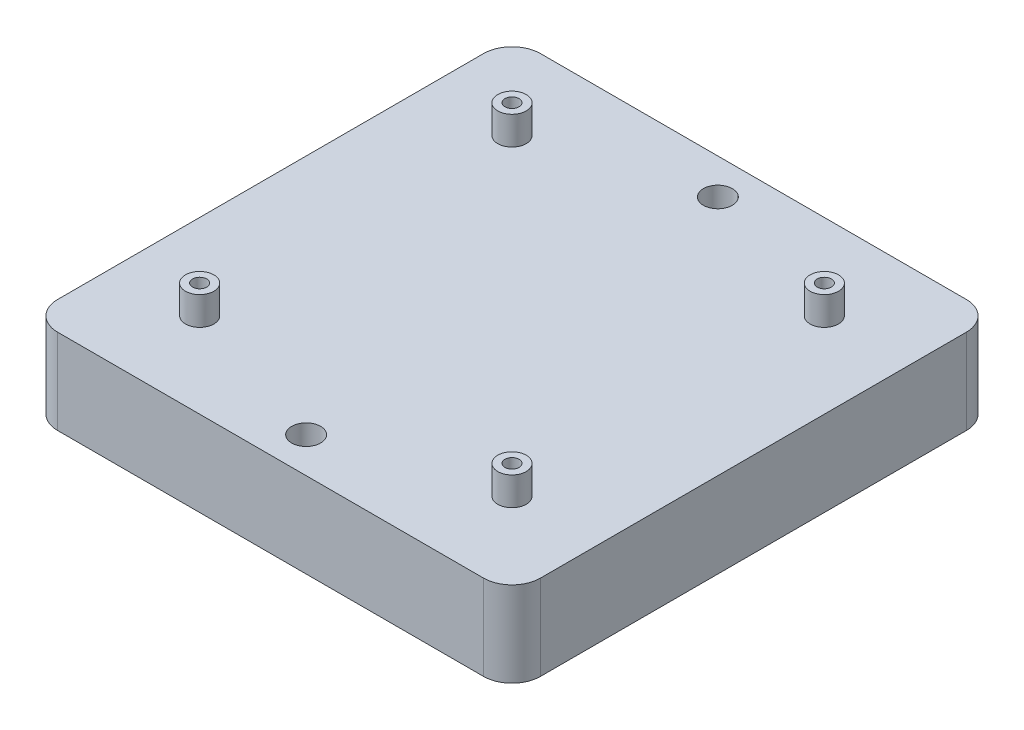
ISO-10303-21;
HEADER;
FILE_DESCRIPTION(('STEP AP214'),'2;1');
FILE_NAME('part.step','',(''),(''),'','','');
FILE_SCHEMA(('AUTOMOTIVE_DESIGN { 1 0 10303 214 1 1 1 1 }'));
ENDSEC;
DATA;
#1=APPLICATION_CONTEXT('core data for automotive mechanical design processes');
#2=APPLICATION_PROTOCOL_DEFINITION('international standard','automotive_design',2000,#1);
#3=PRODUCT_CONTEXT('',#1,'mechanical');
#4=PRODUCT('Part','Part','',(#3));
#5=PRODUCT_RELATED_PRODUCT_CATEGORY('part','',(#4));
#6=PRODUCT_DEFINITION_FORMATION('','',#4);
#7=PRODUCT_DEFINITION_CONTEXT('part definition',#1,'design');
#8=PRODUCT_DEFINITION('design','',#6,#7);
#9=PRODUCT_DEFINITION_SHAPE('','',#8);
#10=(LENGTH_UNIT() NAMED_UNIT(*) SI_UNIT(.MILLI.,.METRE.));
#11=(NAMED_UNIT(*) PLANE_ANGLE_UNIT() SI_UNIT($,.RADIAN.));
#12=(NAMED_UNIT(*) SI_UNIT($,.STERADIAN.) SOLID_ANGLE_UNIT());
#13=UNCERTAINTY_MEASURE_WITH_UNIT(LENGTH_MEASURE(1.E-05),#10,'distance_accuracy_value','');
#14=(GEOMETRIC_REPRESENTATION_CONTEXT(3) GLOBAL_UNCERTAINTY_ASSIGNED_CONTEXT((#13)) GLOBAL_UNIT_ASSIGNED_CONTEXT((#10,
#11,#12)) REPRESENTATION_CONTEXT('',''));
#15=CARTESIAN_POINT('',(0.,0.,0.));
#16=DIRECTION('',(0.,0.,1.));
#17=DIRECTION('',(1.,0.,0.));
#18=AXIS2_PLACEMENT_3D('',#15,#16,#17);
#19=CARTESIAN_POINT('',(0.,30.,0.));
#20=DIRECTION('',(1.,0.,0.));
#21=DIRECTION('',(0.,0.,-1.));
#22=AXIS2_PLACEMENT_3D('',#19,#20,#21);
#23=PLANE('',#22);
#24=DIRECTION('',(0.,0.,1.));
#25=VECTOR('',#24,1.);
#26=CARTESIAN_POINT('',(0.,0.,0.));
#27=LINE('',#26,#25);
#28=CARTESIAN_POINT('',(0.,0.,-160.));
#29=VERTEX_POINT('',#28);
#30=CARTESIAN_POINT('',(0.,0.,-10.));
#31=VERTEX_POINT('',#30);
#32=EDGE_CURVE('E161',#29,#31,#27,.T.);
#33=ORIENTED_EDGE('',*,*,#32,.T.);
#34=DIRECTION('',(0.,-1.,0.));
#35=VECTOR('',#34,1.);
#36=CARTESIAN_POINT('',(0.,30.,-10.));
#37=LINE('',#36,#35);
#38=CARTESIAN_POINT('',(0.,30.,-10.));
#39=VERTEX_POINT('',#38);
#40=EDGE_CURVE('E12',#31,#39,#37,.F.);
#41=ORIENTED_EDGE('',*,*,#40,.T.);
#42=DIRECTION('',(0.,0.,1.));
#43=VECTOR('',#42,1.);
#44=CARTESIAN_POINT('',(0.,30.,0.));
#45=LINE('',#44,#43);
#46=CARTESIAN_POINT('',(0.,30.,-160.));
#47=VERTEX_POINT('',#46);
#48=EDGE_CURVE('E159',#47,#39,#45,.T.);
#49=ORIENTED_EDGE('',*,*,#48,.F.);
#50=DIRECTION('',(0.,-1.,0.));
#51=VECTOR('',#50,1.);
#52=CARTESIAN_POINT('',(0.,30.,-160.));
#53=LINE('',#52,#51);
#54=EDGE_CURVE('E68',#47,#29,#53,.T.);
#55=ORIENTED_EDGE('',*,*,#54,.T.);
#56=EDGE_LOOP('',(#33,#41,#49,#55));
#57=FACE_BOUND('',#56,.T.);
#58=ADVANCED_FACE('F59',(#57),#23,.F.);
#59=CARTESIAN_POINT('',(0.,30.,0.));
#60=DIRECTION('',(0.,0.,-1.));
#61=DIRECTION('',(-1.,0.,0.));
#62=AXIS2_PLACEMENT_3D('',#59,#60,#61);
#63=PLANE('',#62);
#64=DIRECTION('',(1.,0.,0.));
#65=VECTOR('',#64,1.);
#66=CARTESIAN_POINT('',(0.,0.,0.));
#67=LINE('',#66,#65);
#68=CARTESIAN_POINT('',(10.,0.,0.));
#69=VERTEX_POINT('',#68);
#70=CARTESIAN_POINT('',(160.,0.,0.));
#71=VERTEX_POINT('',#70);
#72=EDGE_CURVE('E155',#69,#71,#67,.T.);
#73=ORIENTED_EDGE('',*,*,#72,.T.);
#74=DIRECTION('',(0.,-1.,0.));
#75=VECTOR('',#74,1.);
#76=CARTESIAN_POINT('',(160.,30.,0.));
#77=LINE('',#76,#75);
#78=CARTESIAN_POINT('',(160.,30.,0.));
#79=VERTEX_POINT('',#78);
#80=EDGE_CURVE('E131',#71,#79,#77,.F.);
#81=ORIENTED_EDGE('',*,*,#80,.T.);
#82=DIRECTION('',(1.,0.,0.));
#83=VECTOR('',#82,1.);
#84=CARTESIAN_POINT('',(0.,30.,0.));
#85=LINE('',#84,#83);
#86=CARTESIAN_POINT('',(10.,30.,0.));
#87=VERTEX_POINT('',#86);
#88=EDGE_CURVE('E234',#87,#79,#85,.T.);
#89=ORIENTED_EDGE('',*,*,#88,.F.);
#90=DIRECTION('',(0.,-1.,0.));
#91=VECTOR('',#90,1.);
#92=CARTESIAN_POINT('',(10.,30.,0.));
#93=LINE('',#92,#91);
#94=EDGE_CURVE('E137',#87,#69,#93,.T.);
#95=ORIENTED_EDGE('',*,*,#94,.T.);
#96=EDGE_LOOP('',(#73,#81,#89,#95));
#97=FACE_BOUND('',#96,.T.);
#98=ADVANCED_FACE('F330',(#97),#63,.F.);
#99=CARTESIAN_POINT('',(170.,30.,0.));
#100=DIRECTION('',(-1.,0.,0.));
#101=DIRECTION('',(0.,0.,1.));
#102=AXIS2_PLACEMENT_3D('',#99,#100,#101);
#103=PLANE('',#102);
#104=DIRECTION('',(0.,0.,-1.));
#105=VECTOR('',#104,1.);
#106=CARTESIAN_POINT('',(170.,30.,0.));
#107=LINE('',#106,#105);
#108=CARTESIAN_POINT('',(170.,30.,-10.));
#109=VERTEX_POINT('',#108);
#110=CARTESIAN_POINT('',(170.,30.,-160.));
#111=VERTEX_POINT('',#110);
#112=EDGE_CURVE('E146',#109,#111,#107,.T.);
#113=ORIENTED_EDGE('',*,*,#112,.F.);
#114=DIRECTION('',(0.,-1.,0.));
#115=VECTOR('',#114,1.);
#116=CARTESIAN_POINT('',(170.,30.,-10.));
#117=LINE('',#116,#115);
#118=CARTESIAN_POINT('',(170.,0.,-10.));
#119=VERTEX_POINT('',#118);
#120=EDGE_CURVE('E130',#109,#119,#117,.T.);
#121=ORIENTED_EDGE('',*,*,#120,.T.);
#122=DIRECTION('',(0.,0.,-1.));
#123=VECTOR('',#122,1.);
#124=CARTESIAN_POINT('',(170.,0.,0.));
#125=LINE('',#124,#123);
#126=CARTESIAN_POINT('',(170.,0.,-160.));
#127=VERTEX_POINT('',#126);
#128=EDGE_CURVE('E144',#119,#127,#125,.T.);
#129=ORIENTED_EDGE('',*,*,#128,.T.);
#130=DIRECTION('',(0.,-1.,0.));
#131=VECTOR('',#130,1.);
#132=CARTESIAN_POINT('',(170.,30.,-160.));
#133=LINE('',#132,#131);
#134=EDGE_CURVE('E149',#127,#111,#133,.F.);
#135=ORIENTED_EDGE('',*,*,#134,.T.);
#136=EDGE_LOOP('',(#113,#121,#129,#135));
#137=FACE_BOUND('',#136,.T.);
#138=ADVANCED_FACE('F143',(#137),#103,.F.);
#139=CARTESIAN_POINT('',(0.,30.,-170.));
#140=DIRECTION('',(0.,0.,1.));
#141=DIRECTION('',(1.,0.,0.));
#142=AXIS2_PLACEMENT_3D('',#139,#140,#141);
#143=PLANE('',#142);
#144=DIRECTION('',(-1.,0.,0.));
#145=VECTOR('',#144,1.);
#146=CARTESIAN_POINT('',(0.,30.,-170.));
#147=LINE('',#146,#145);
#148=CARTESIAN_POINT('',(160.,30.,-170.));
#149=VERTEX_POINT('',#148);
#150=CARTESIAN_POINT('',(10.,30.,-170.));
#151=VERTEX_POINT('',#150);
#152=EDGE_CURVE('E170',#149,#151,#147,.T.);
#153=ORIENTED_EDGE('',*,*,#152,.F.);
#154=DIRECTION('',(0.,-1.,0.));
#155=VECTOR('',#154,1.);
#156=CARTESIAN_POINT('',(160.,30.,-170.));
#157=LINE('',#156,#155);
#158=CARTESIAN_POINT('',(160.,0.,-170.));
#159=VERTEX_POINT('',#158);
#160=EDGE_CURVE('E209',#149,#159,#157,.T.);
#161=ORIENTED_EDGE('',*,*,#160,.T.);
#162=DIRECTION('',(-1.,0.,0.));
#163=VECTOR('',#162,1.);
#164=CARTESIAN_POINT('',(0.,0.,-170.));
#165=LINE('',#164,#163);
#166=CARTESIAN_POINT('',(10.,0.,-170.));
#167=VERTEX_POINT('',#166);
#168=EDGE_CURVE('E154',#159,#167,#165,.T.);
#169=ORIENTED_EDGE('',*,*,#168,.T.);
#170=DIRECTION('',(0.,-1.,0.));
#171=VECTOR('',#170,1.);
#172=CARTESIAN_POINT('',(10.,30.,-170.));
#173=LINE('',#172,#171);
#174=EDGE_CURVE('E75',#167,#151,#173,.F.);
#175=ORIENTED_EDGE('',*,*,#174,.T.);
#176=EDGE_LOOP('',(#153,#161,#169,#175));
#177=FACE_BOUND('',#176,.T.);
#178=ADVANCED_FACE('F313',(#177),#143,.F.);
#179=CARTESIAN_POINT('',(0.,30.,0.));
#180=DIRECTION('',(0.,-1.,0.));
#181=DIRECTION('',(0.,0.,-1.));
#182=AXIS2_PLACEMENT_3D('',#179,#180,#181);
#183=PLANE('',#182);
#184=CARTESIAN_POINT('',(140.,30.,-30.));
#185=DIRECTION('',(0.,-1.,0.));
#186=DIRECTION('',(0.,0.,-1.));
#187=AXIS2_PLACEMENT_3D('',#184,#185,#186);
#188=CIRCLE('',#187,4.99999999999999);
#189=CARTESIAN_POINT('',(140.,30.,-35.));
#190=VERTEX_POINT('',#189);
#191=EDGE_CURVE('E178',#190,#190,#188,.F.);
#192=ORIENTED_EDGE('',*,*,#191,.F.);
#193=EDGE_LOOP('',(#192));
#194=FACE_BOUND('',#193,.T.);
#195=CARTESIAN_POINT('',(140.,30.,-140.));
#196=DIRECTION('',(0.,-1.,0.));
#197=DIRECTION('',(0.,0.,-1.));
#198=AXIS2_PLACEMENT_3D('',#195,#196,#197);
#199=CIRCLE('',#198,4.99999999999998);
#200=CARTESIAN_POINT('',(140.,30.,-145.));
#201=VERTEX_POINT('',#200);
#202=EDGE_CURVE('E174',#201,#201,#199,.F.);
#203=ORIENTED_EDGE('',*,*,#202,.F.);
#204=EDGE_LOOP('',(#203));
#205=FACE_BOUND('',#204,.T.);
#206=CARTESIAN_POINT('',(29.9999999999996,30.,-140.));
#207=DIRECTION('',(0.,-1.,0.));
#208=DIRECTION('',(0.,0.,-1.));
#209=AXIS2_PLACEMENT_3D('',#206,#207,#208);
#210=CIRCLE('',#209,4.99999999999999);
#211=CARTESIAN_POINT('',(29.9999999999996,30.,-145.));
#212=VERTEX_POINT('',#211);
#213=EDGE_CURVE('E169',#212,#212,#210,.F.);
#214=ORIENTED_EDGE('',*,*,#213,.F.);
#215=EDGE_LOOP('',(#214));
#216=FACE_BOUND('',#215,.T.);
#217=CARTESIAN_POINT('',(30.,30.,-30.));
#218=DIRECTION('',(0.,-1.,0.));
#219=DIRECTION('',(0.,0.,-1.));
#220=AXIS2_PLACEMENT_3D('',#217,#218,#219);
#221=CIRCLE('',#220,5.);
#222=CARTESIAN_POINT('',(30.,30.,-35.));
#223=VERTEX_POINT('',#222);
#224=EDGE_CURVE('E165',#223,#223,#221,.F.);
#225=ORIENTED_EDGE('',*,*,#224,.F.);
#226=EDGE_LOOP('',(#225));
#227=FACE_BOUND('',#226,.T.);
#228=CARTESIAN_POINT('',(85.,30.,-157.5));
#229=DIRECTION('',(0.,1.,0.));
#230=DIRECTION('',(0.,0.,1.));
#231=AXIS2_PLACEMENT_3D('',#228,#229,#230);
#232=CIRCLE('',#231,5.1);
#233=CARTESIAN_POINT('',(85.,30.,-152.4));
#234=VERTEX_POINT('',#233);
#235=EDGE_CURVE('E227',#234,#234,#232,.T.);
#236=ORIENTED_EDGE('',*,*,#235,.F.);
#237=EDGE_LOOP('',(#236));
#238=FACE_BOUND('',#237,.T.);
#239=CARTESIAN_POINT('',(85.,30.,-12.5));
#240=DIRECTION('',(0.,1.,0.));
#241=DIRECTION('',(0.,0.,1.));
#242=AXIS2_PLACEMENT_3D('',#239,#240,#241);
#243=CIRCLE('',#242,5.1);
#244=CARTESIAN_POINT('',(85.,30.,-7.4));
#245=VERTEX_POINT('',#244);
#246=EDGE_CURVE('E244',#245,#245,#243,.T.);
#247=ORIENTED_EDGE('',*,*,#246,.F.);
#248=EDGE_LOOP('',(#247));
#249=FACE_BOUND('',#248,.T.);
#250=ORIENTED_EDGE('',*,*,#88,.T.);
#251=CARTESIAN_POINT('',(160.,30.,-10.));
#252=DIRECTION('',(0.,-1.,0.));
#253=DIRECTION('',(0.,0.,-1.));
#254=AXIS2_PLACEMENT_3D('',#251,#252,#253);
#255=CIRCLE('',#254,10.);
#256=EDGE_CURVE('E204',#79,#109,#255,.F.);
#257=ORIENTED_EDGE('',*,*,#256,.T.);
#258=ORIENTED_EDGE('',*,*,#112,.T.);
#259=CARTESIAN_POINT('',(160.,30.,-160.));
#260=DIRECTION('',(0.,-1.,0.));
#261=DIRECTION('',(0.,0.,-1.));
#262=AXIS2_PLACEMENT_3D('',#259,#260,#261);
#263=CIRCLE('',#262,10.);
#264=EDGE_CURVE('E82',#111,#149,#263,.F.);
#265=ORIENTED_EDGE('',*,*,#264,.T.);
#266=ORIENTED_EDGE('',*,*,#152,.T.);
#267=CARTESIAN_POINT('',(10.,30.,-160.));
#268=DIRECTION('',(0.,-1.,0.));
#269=DIRECTION('',(0.,0.,-1.));
#270=AXIS2_PLACEMENT_3D('',#267,#268,#269);
#271=CIRCLE('',#270,10.);
#272=EDGE_CURVE('E196',#151,#47,#271,.F.);
#273=ORIENTED_EDGE('',*,*,#272,.T.);
#274=ORIENTED_EDGE('',*,*,#48,.T.);
#275=CARTESIAN_POINT('',(10.,30.,-10.));
#276=DIRECTION('',(0.,-1.,0.));
#277=DIRECTION('',(0.,0.,-1.));
#278=AXIS2_PLACEMENT_3D('',#275,#276,#277);
#279=CIRCLE('',#278,10.);
#280=EDGE_CURVE('E199',#39,#87,#279,.F.);
#281=ORIENTED_EDGE('',*,*,#280,.T.);
#282=EDGE_LOOP('',(#250,#257,#258,#265,#266,#273,#274,#281));
#283=FACE_BOUND('',#282,.T.);
#284=ADVANCED_FACE('F310',(#194,#205,#216,#227,#238,#249,#283),#183,.F.);
#285=CARTESIAN_POINT('',(0.,0.,0.));
#286=DIRECTION('',(0.,-1.,0.));
#287=DIRECTION('',(0.,0.,-1.));
#288=AXIS2_PLACEMENT_3D('',#285,#286,#287);
#289=PLANE('',#288);
#290=ORIENTED_EDGE('',*,*,#128,.F.);
#291=CARTESIAN_POINT('',(160.,0.,-10.));
#292=DIRECTION('',(0.,-1.,0.));
#293=DIRECTION('',(0.,0.,-1.));
#294=AXIS2_PLACEMENT_3D('',#291,#292,#293);
#295=CIRCLE('',#294,10.);
#296=EDGE_CURVE('E126',#119,#71,#295,.T.);
#297=ORIENTED_EDGE('',*,*,#296,.T.);
#298=ORIENTED_EDGE('',*,*,#72,.F.);
#299=CARTESIAN_POINT('',(10.,0.,-10.));
#300=DIRECTION('',(0.,-1.,0.));
#301=DIRECTION('',(0.,0.,-1.));
#302=AXIS2_PLACEMENT_3D('',#299,#300,#301);
#303=CIRCLE('',#302,10.);
#304=EDGE_CURVE('E186',#69,#31,#303,.T.);
#305=ORIENTED_EDGE('',*,*,#304,.T.);
#306=ORIENTED_EDGE('',*,*,#32,.F.);
#307=CARTESIAN_POINT('',(10.,0.,-160.));
#308=DIRECTION('',(0.,-1.,0.));
#309=DIRECTION('',(0.,0.,-1.));
#310=AXIS2_PLACEMENT_3D('',#307,#308,#309);
#311=CIRCLE('',#310,10.);
#312=EDGE_CURVE('E148',#29,#167,#311,.T.);
#313=ORIENTED_EDGE('',*,*,#312,.T.);
#314=ORIENTED_EDGE('',*,*,#168,.F.);
#315=CARTESIAN_POINT('',(160.,0.,-160.));
#316=DIRECTION('',(0.,-1.,0.));
#317=DIRECTION('',(0.,0.,-1.));
#318=AXIS2_PLACEMENT_3D('',#315,#316,#317);
#319=CIRCLE('',#318,10.);
#320=EDGE_CURVE('E138',#159,#127,#319,.T.);
#321=ORIENTED_EDGE('',*,*,#320,.T.);
#322=EDGE_LOOP('',(#290,#297,#298,#305,#306,#313,#314,#321));
#323=FACE_BOUND('',#322,.T.);
#324=ADVANCED_FACE('F151',(#323),#289,.T.);
#325=CARTESIAN_POINT('',(85.,5.,-12.5));
#326=DIRECTION('',(0.,1.,0.));
#327=DIRECTION('',(0.,0.,1.));
#328=AXIS2_PLACEMENT_3D('',#325,#326,#327);
#329=CYLINDRICAL_SURFACE('',#328,5.1);
#330=CARTESIAN_POINT('',(85.,5.,-12.5));
#331=DIRECTION('',(0.,1.,0.));
#332=DIRECTION('',(0.,0.,1.));
#333=AXIS2_PLACEMENT_3D('',#330,#331,#332);
#334=CIRCLE('',#333,5.1);
#335=CARTESIAN_POINT('',(85.,5.,-7.4));
#336=VERTEX_POINT('',#335);
#337=EDGE_CURVE('E240',#336,#336,#334,.T.);
#338=ORIENTED_EDGE('',*,*,#337,.F.);
#339=EDGE_LOOP('',(#338));
#340=FACE_BOUND('',#339,.T.);
#341=ORIENTED_EDGE('',*,*,#246,.T.);
#342=EDGE_LOOP('',(#341));
#343=FACE_BOUND('',#342,.T.);
#344=ADVANCED_FACE('F360',(#340,#343),#329,.F.);
#345=CARTESIAN_POINT('',(85.,5.,-12.5));
#346=DIRECTION('',(0.,1.,0.));
#347=DIRECTION('',(0.,0.,1.));
#348=AXIS2_PLACEMENT_3D('',#345,#346,#347);
#349=PLANE('',#348);
#350=ORIENTED_EDGE('',*,*,#337,.T.);
#351=EDGE_LOOP('',(#350));
#352=FACE_BOUND('',#351,.T.);
#353=ADVANCED_FACE('F362',(#352),#349,.T.);
#354=CARTESIAN_POINT('',(85.,5.,-157.5));
#355=DIRECTION('',(0.,1.,0.));
#356=DIRECTION('',(0.,0.,1.));
#357=AXIS2_PLACEMENT_3D('',#354,#355,#356);
#358=CYLINDRICAL_SURFACE('',#357,5.1);
#359=CARTESIAN_POINT('',(85.,5.,-157.5));
#360=DIRECTION('',(0.,1.,0.));
#361=DIRECTION('',(0.,0.,1.));
#362=AXIS2_PLACEMENT_3D('',#359,#360,#361);
#363=CIRCLE('',#362,5.1);
#364=CARTESIAN_POINT('',(85.,5.,-152.4));
#365=VERTEX_POINT('',#364);
#366=EDGE_CURVE('E224',#365,#365,#363,.T.);
#367=ORIENTED_EDGE('',*,*,#366,.F.);
#368=EDGE_LOOP('',(#367));
#369=FACE_BOUND('',#368,.T.);
#370=ORIENTED_EDGE('',*,*,#235,.T.);
#371=EDGE_LOOP('',(#370));
#372=FACE_BOUND('',#371,.T.);
#373=ADVANCED_FACE('F365',(#369,#372),#358,.F.);
#374=CARTESIAN_POINT('',(85.,5.,-157.5));
#375=DIRECTION('',(0.,1.,0.));
#376=DIRECTION('',(0.,0.,1.));
#377=AXIS2_PLACEMENT_3D('',#374,#375,#376);
#378=PLANE('',#377);
#379=ORIENTED_EDGE('',*,*,#366,.T.);
#380=EDGE_LOOP('',(#379));
#381=FACE_BOUND('',#380,.T.);
#382=ADVANCED_FACE('F372',(#381),#378,.T.);
#383=CARTESIAN_POINT('',(30.,40.,-30.));
#384=DIRECTION('',(0.,-1.,0.));
#385=DIRECTION('',(0.,0.,-1.));
#386=AXIS2_PLACEMENT_3D('',#383,#384,#385);
#387=CYLINDRICAL_SURFACE('',#386,2.5);
#388=CARTESIAN_POINT('',(30.,40.,-30.));
#389=DIRECTION('',(0.,1.,0.));
#390=DIRECTION('',(0.,0.,1.));
#391=AXIS2_PLACEMENT_3D('',#388,#389,#390);
#392=CIRCLE('',#391,2.5);
#393=CARTESIAN_POINT('',(30.,40.,-27.5));
#394=VERTEX_POINT('',#393);
#395=EDGE_CURVE('E256',#394,#394,#392,.T.);
#396=ORIENTED_EDGE('',*,*,#395,.T.);
#397=EDGE_LOOP('',(#396));
#398=FACE_BOUND('',#397,.T.);
#399=CARTESIAN_POINT('',(30.,30.,-30.));
#400=DIRECTION('',(0.,1.,0.));
#401=DIRECTION('',(0.,0.,1.));
#402=AXIS2_PLACEMENT_3D('',#399,#400,#401);
#403=CIRCLE('',#402,2.5);
#404=CARTESIAN_POINT('',(30.,30.,-27.5));
#405=VERTEX_POINT('',#404);
#406=EDGE_CURVE('E252',#405,#405,#403,.T.);
#407=ORIENTED_EDGE('',*,*,#406,.F.);
#408=EDGE_LOOP('',(#407));
#409=FACE_BOUND('',#408,.T.);
#410=ADVANCED_FACE('F376',(#398,#409),#387,.F.);
#411=CARTESIAN_POINT('',(30.,40.,-30.));
#412=DIRECTION('',(0.,-1.,0.));
#413=DIRECTION('',(0.,0.,-1.));
#414=AXIS2_PLACEMENT_3D('',#411,#412,#413);
#415=CYLINDRICAL_SURFACE('',#414,5.);
#416=CARTESIAN_POINT('',(30.,40.,-30.));
#417=DIRECTION('',(0.,1.,0.));
#418=DIRECTION('',(0.,0.,1.));
#419=AXIS2_PLACEMENT_3D('',#416,#417,#418);
#420=CIRCLE('',#419,5.);
#421=CARTESIAN_POINT('',(30.,40.,-25.));
#422=VERTEX_POINT('',#421);
#423=EDGE_CURVE('E245',#422,#422,#420,.T.);
#424=ORIENTED_EDGE('',*,*,#423,.F.);
#425=EDGE_LOOP('',(#424));
#426=FACE_BOUND('',#425,.T.);
#427=ORIENTED_EDGE('',*,*,#224,.T.);
#428=EDGE_LOOP('',(#427));
#429=FACE_BOUND('',#428,.T.);
#430=ADVANCED_FACE('F380',(#426,#429),#415,.T.);
#431=CARTESIAN_POINT('',(0.,40.,0.));
#432=DIRECTION('',(0.,1.,0.));
#433=DIRECTION('',(0.,0.,1.));
#434=AXIS2_PLACEMENT_3D('',#431,#432,#433);
#435=PLANE('',#434);
#436=ORIENTED_EDGE('',*,*,#395,.F.);
#437=EDGE_LOOP('',(#436));
#438=FACE_BOUND('',#437,.T.);
#439=ORIENTED_EDGE('',*,*,#423,.T.);
#440=EDGE_LOOP('',(#439));
#441=FACE_BOUND('',#440,.T.);
#442=ADVANCED_FACE('F384',(#438,#441),#435,.T.);
#443=ORIENTED_EDGE('',*,*,#406,.T.);
#444=EDGE_LOOP('',(#443));
#445=FACE_BOUND('',#444,.T.);
#446=ADVANCED_FACE('F316',(#445),#183,.F.);
#447=CARTESIAN_POINT('',(29.9999999999996,40.,-140.));
#448=DIRECTION('',(0.,1.,0.));
#449=DIRECTION('',(0.,0.,1.));
#450=AXIS2_PLACEMENT_3D('',#447,#448,#449);
#451=PLANE('',#450);
#452=CARTESIAN_POINT('',(29.9999999999996,40.,-140.));
#453=DIRECTION('',(0.,1.,0.));
#454=DIRECTION('',(0.,0.,1.));
#455=AXIS2_PLACEMENT_3D('',#452,#453,#454);
#456=CIRCLE('',#455,4.99999999999999);
#457=CARTESIAN_POINT('',(29.9999999999996,40.,-135.));
#458=VERTEX_POINT('',#457);
#459=EDGE_CURVE('E268',#458,#458,#456,.T.);
#460=ORIENTED_EDGE('',*,*,#459,.T.);
#461=EDGE_LOOP('',(#460));
#462=FACE_BOUND('',#461,.T.);
#463=CARTESIAN_POINT('',(29.9999999999996,40.,-140.));
#464=DIRECTION('',(0.,1.,0.));
#465=DIRECTION('',(0.,0.,1.));
#466=AXIS2_PLACEMENT_3D('',#463,#464,#465);
#467=CIRCLE('',#466,2.50000000000001);
#468=CARTESIAN_POINT('',(29.9999999999996,40.,-137.5));
#469=VERTEX_POINT('',#468);
#470=EDGE_CURVE('E264',#469,#469,#467,.T.);
#471=ORIENTED_EDGE('',*,*,#470,.F.);
#472=EDGE_LOOP('',(#471));
#473=FACE_BOUND('',#472,.T.);
#474=ADVANCED_FACE('F395',(#462,#473),#451,.T.);
#475=CARTESIAN_POINT('',(29.9999999999996,40.,-140.));
#476=DIRECTION('',(0.,-1.,0.));
#477=DIRECTION('',(0.,0.,-1.));
#478=AXIS2_PLACEMENT_3D('',#475,#476,#477);
#479=CYLINDRICAL_SURFACE('',#478,4.99999999999999);
#480=ORIENTED_EDGE('',*,*,#459,.F.);
#481=EDGE_LOOP('',(#480));
#482=FACE_BOUND('',#481,.T.);
#483=ORIENTED_EDGE('',*,*,#213,.T.);
#484=EDGE_LOOP('',(#483));
#485=FACE_BOUND('',#484,.T.);
#486=ADVANCED_FACE('F393',(#482,#485),#479,.T.);
#487=CARTESIAN_POINT('',(29.9999999999996,40.,-140.));
#488=DIRECTION('',(0.,-1.,0.));
#489=DIRECTION('',(0.,0.,-1.));
#490=AXIS2_PLACEMENT_3D('',#487,#488,#489);
#491=CYLINDRICAL_SURFACE('',#490,2.50000000000001);
#492=ORIENTED_EDGE('',*,*,#470,.T.);
#493=EDGE_LOOP('',(#492));
#494=FACE_BOUND('',#493,.T.);
#495=CARTESIAN_POINT('',(29.9999999999996,30.,-140.));
#496=DIRECTION('',(0.,1.,0.));
#497=DIRECTION('',(0.,0.,1.));
#498=AXIS2_PLACEMENT_3D('',#495,#496,#497);
#499=CIRCLE('',#498,2.50000000000001);
#500=CARTESIAN_POINT('',(29.9999999999996,30.,-137.5));
#501=VERTEX_POINT('',#500);
#502=EDGE_CURVE('E257',#501,#501,#499,.T.);
#503=ORIENTED_EDGE('',*,*,#502,.F.);
#504=EDGE_LOOP('',(#503));
#505=FACE_BOUND('',#504,.T.);
#506=ADVANCED_FACE('F389',(#494,#505),#491,.F.);
#507=ORIENTED_EDGE('',*,*,#502,.T.);
#508=EDGE_LOOP('',(#507));
#509=FACE_BOUND('',#508,.T.);
#510=ADVANCED_FACE('F392',(#509),#183,.F.);
#511=CARTESIAN_POINT('',(140.,40.,-140.));
#512=DIRECTION('',(0.,1.,0.));
#513=DIRECTION('',(0.,0.,1.));
#514=AXIS2_PLACEMENT_3D('',#511,#512,#513);
#515=PLANE('',#514);
#516=CARTESIAN_POINT('',(140.,40.,-140.));
#517=DIRECTION('',(0.,1.,0.));
#518=DIRECTION('',(0.,0.,1.));
#519=AXIS2_PLACEMENT_3D('',#516,#517,#518);
#520=CIRCLE('',#519,4.99999999999998);
#521=CARTESIAN_POINT('',(140.,40.,-135.));
#522=VERTEX_POINT('',#521);
#523=EDGE_CURVE('E280',#522,#522,#520,.T.);
#524=ORIENTED_EDGE('',*,*,#523,.T.);
#525=EDGE_LOOP('',(#524));
#526=FACE_BOUND('',#525,.T.);
#527=CARTESIAN_POINT('',(140.,40.,-140.));
#528=DIRECTION('',(0.,1.,0.));
#529=DIRECTION('',(0.,0.,1.));
#530=AXIS2_PLACEMENT_3D('',#527,#528,#529);
#531=CIRCLE('',#530,2.5);
#532=CARTESIAN_POINT('',(140.,40.,-137.5));
#533=VERTEX_POINT('',#532);
#534=EDGE_CURVE('E276',#533,#533,#531,.T.);
#535=ORIENTED_EDGE('',*,*,#534,.F.);
#536=EDGE_LOOP('',(#535));
#537=FACE_BOUND('',#536,.T.);
#538=ADVANCED_FACE('F408',(#526,#537),#515,.T.);
#539=CARTESIAN_POINT('',(140.,40.,-140.));
#540=DIRECTION('',(0.,-1.,0.));
#541=DIRECTION('',(0.,0.,-1.));
#542=AXIS2_PLACEMENT_3D('',#539,#540,#541);
#543=CYLINDRICAL_SURFACE('',#542,4.99999999999998);
#544=ORIENTED_EDGE('',*,*,#523,.F.);
#545=EDGE_LOOP('',(#544));
#546=FACE_BOUND('',#545,.T.);
#547=ORIENTED_EDGE('',*,*,#202,.T.);
#548=EDGE_LOOP('',(#547));
#549=FACE_BOUND('',#548,.T.);
#550=ADVANCED_FACE('F406',(#546,#549),#543,.T.);
#551=CARTESIAN_POINT('',(140.,40.,-140.));
#552=DIRECTION('',(0.,-1.,0.));
#553=DIRECTION('',(0.,0.,-1.));
#554=AXIS2_PLACEMENT_3D('',#551,#552,#553);
#555=CYLINDRICAL_SURFACE('',#554,2.5);
#556=ORIENTED_EDGE('',*,*,#534,.T.);
#557=EDGE_LOOP('',(#556));
#558=FACE_BOUND('',#557,.T.);
#559=CARTESIAN_POINT('',(140.,30.,-140.));
#560=DIRECTION('',(0.,1.,0.));
#561=DIRECTION('',(0.,0.,1.));
#562=AXIS2_PLACEMENT_3D('',#559,#560,#561);
#563=CIRCLE('',#562,2.5);
#564=CARTESIAN_POINT('',(140.,30.,-137.5));
#565=VERTEX_POINT('',#564);
#566=EDGE_CURVE('E275',#565,#565,#563,.T.);
#567=ORIENTED_EDGE('',*,*,#566,.F.);
#568=EDGE_LOOP('',(#567));
#569=FACE_BOUND('',#568,.T.);
#570=ADVANCED_FACE('F402',(#558,#569),#555,.F.);
#571=ORIENTED_EDGE('',*,*,#566,.T.);
#572=EDGE_LOOP('',(#571));
#573=FACE_BOUND('',#572,.T.);
#574=ADVANCED_FACE('F405',(#573),#183,.F.);
#575=CARTESIAN_POINT('',(140.,40.,-30.));
#576=DIRECTION('',(0.,1.,0.));
#577=DIRECTION('',(0.,0.,1.));
#578=AXIS2_PLACEMENT_3D('',#575,#576,#577);
#579=PLANE('',#578);
#580=CARTESIAN_POINT('',(140.,40.,-30.));
#581=DIRECTION('',(0.,1.,0.));
#582=DIRECTION('',(0.,0.,1.));
#583=AXIS2_PLACEMENT_3D('',#580,#581,#582);
#584=CIRCLE('',#583,4.99999999999999);
#585=CARTESIAN_POINT('',(140.,40.,-25.));
#586=VERTEX_POINT('',#585);
#587=EDGE_CURVE('E292',#586,#586,#584,.T.);
#588=ORIENTED_EDGE('',*,*,#587,.T.);
#589=EDGE_LOOP('',(#588));
#590=FACE_BOUND('',#589,.T.);
#591=CARTESIAN_POINT('',(140.,40.,-30.));
#592=DIRECTION('',(0.,1.,0.));
#593=DIRECTION('',(0.,0.,1.));
#594=AXIS2_PLACEMENT_3D('',#591,#592,#593);
#595=CIRCLE('',#594,2.5);
#596=CARTESIAN_POINT('',(140.,40.,-27.5));
#597=VERTEX_POINT('',#596);
#598=EDGE_CURVE('E288',#597,#597,#595,.T.);
#599=ORIENTED_EDGE('',*,*,#598,.F.);
#600=EDGE_LOOP('',(#599));
#601=FACE_BOUND('',#600,.T.);
#602=ADVANCED_FACE('F300',(#590,#601),#579,.T.);
#603=CARTESIAN_POINT('',(140.,40.,-30.));
#604=DIRECTION('',(0.,-1.,0.));
#605=DIRECTION('',(0.,0.,-1.));
#606=AXIS2_PLACEMENT_3D('',#603,#604,#605);
#607=CYLINDRICAL_SURFACE('',#606,4.99999999999999);
#608=ORIENTED_EDGE('',*,*,#587,.F.);
#609=EDGE_LOOP('',(#608));
#610=FACE_BOUND('',#609,.T.);
#611=ORIENTED_EDGE('',*,*,#191,.T.);
#612=EDGE_LOOP('',(#611));
#613=FACE_BOUND('',#612,.T.);
#614=ADVANCED_FACE('F303',(#610,#613),#607,.T.);
#615=CARTESIAN_POINT('',(140.,40.,-30.));
#616=DIRECTION('',(0.,-1.,0.));
#617=DIRECTION('',(0.,0.,-1.));
#618=AXIS2_PLACEMENT_3D('',#615,#616,#617);
#619=CYLINDRICAL_SURFACE('',#618,2.5);
#620=ORIENTED_EDGE('',*,*,#598,.T.);
#621=EDGE_LOOP('',(#620));
#622=FACE_BOUND('',#621,.T.);
#623=CARTESIAN_POINT('',(140.,30.,-30.));
#624=DIRECTION('',(0.,1.,0.));
#625=DIRECTION('',(0.,0.,1.));
#626=AXIS2_PLACEMENT_3D('',#623,#624,#625);
#627=CIRCLE('',#626,2.5);
#628=CARTESIAN_POINT('',(140.,30.,-27.5));
#629=VERTEX_POINT('',#628);
#630=EDGE_CURVE('E287',#629,#629,#627,.T.);
#631=ORIENTED_EDGE('',*,*,#630,.F.);
#632=EDGE_LOOP('',(#631));
#633=FACE_BOUND('',#632,.T.);
#634=ADVANCED_FACE('F306',(#622,#633),#619,.F.);
#635=ORIENTED_EDGE('',*,*,#630,.T.);
#636=EDGE_LOOP('',(#635));
#637=FACE_BOUND('',#636,.T.);
#638=ADVANCED_FACE('F315',(#637),#183,.F.);
#639=CARTESIAN_POINT('',(160.,30.,-10.));
#640=DIRECTION('',(0.,-1.,0.));
#641=DIRECTION('',(0.,0.,-1.));
#642=AXIS2_PLACEMENT_3D('',#639,#640,#641);
#643=CYLINDRICAL_SURFACE('',#642,10.);
#644=ORIENTED_EDGE('',*,*,#256,.F.);
#645=ORIENTED_EDGE('',*,*,#80,.F.);
#646=ORIENTED_EDGE('',*,*,#296,.F.);
#647=ORIENTED_EDGE('',*,*,#120,.F.);
#648=EDGE_LOOP('',(#644,#645,#646,#647));
#649=FACE_BOUND('',#648,.T.);
#650=ADVANCED_FACE('F129',(#649),#643,.T.);
#651=CARTESIAN_POINT('',(160.,30.,-160.));
#652=DIRECTION('',(0.,-1.,0.));
#653=DIRECTION('',(0.,0.,-1.));
#654=AXIS2_PLACEMENT_3D('',#651,#652,#653);
#655=CYLINDRICAL_SURFACE('',#654,10.);
#656=ORIENTED_EDGE('',*,*,#264,.F.);
#657=ORIENTED_EDGE('',*,*,#134,.F.);
#658=ORIENTED_EDGE('',*,*,#320,.F.);
#659=ORIENTED_EDGE('',*,*,#160,.F.);
#660=EDGE_LOOP('',(#656,#657,#658,#659));
#661=FACE_BOUND('',#660,.T.);
#662=ADVANCED_FACE('F337',(#661),#655,.T.);
#663=CARTESIAN_POINT('',(10.,30.,-10.));
#664=DIRECTION('',(0.,-1.,0.));
#665=DIRECTION('',(0.,0.,-1.));
#666=AXIS2_PLACEMENT_3D('',#663,#664,#665);
#667=CYLINDRICAL_SURFACE('',#666,10.);
#668=ORIENTED_EDGE('',*,*,#280,.F.);
#669=ORIENTED_EDGE('',*,*,#40,.F.);
#670=ORIENTED_EDGE('',*,*,#304,.F.);
#671=ORIENTED_EDGE('',*,*,#94,.F.);
#672=EDGE_LOOP('',(#668,#669,#670,#671));
#673=FACE_BOUND('',#672,.T.);
#674=ADVANCED_FACE('F332',(#673),#667,.T.);
#675=CARTESIAN_POINT('',(10.,30.,-160.));
#676=DIRECTION('',(0.,-1.,0.));
#677=DIRECTION('',(0.,0.,-1.));
#678=AXIS2_PLACEMENT_3D('',#675,#676,#677);
#679=CYLINDRICAL_SURFACE('',#678,10.);
#680=ORIENTED_EDGE('',*,*,#272,.F.);
#681=ORIENTED_EDGE('',*,*,#174,.F.);
#682=ORIENTED_EDGE('',*,*,#312,.F.);
#683=ORIENTED_EDGE('',*,*,#54,.F.);
#684=EDGE_LOOP('',(#680,#681,#682,#683));
#685=FACE_BOUND('',#684,.T.);
#686=ADVANCED_FACE('F61',(#685),#679,.T.);
#687=CLOSED_SHELL('',(#58,#98,#138,#178,#284,#324,#344,#353,#373,#382,#410,#430,#442,#446,#474,
#486,#506,#510,#538,#550,#570,#574,#602,#614,#634,#638,#650,#662,#674,#686));
#688=MANIFOLD_SOLID_BREP('B2',#687);
#689=ADVANCED_BREP_SHAPE_REPRESENTATION('',(#18,#688),#14);
#690=SHAPE_DEFINITION_REPRESENTATION(#9,#689);
ENDSEC;
END-ISO-10303-21;
